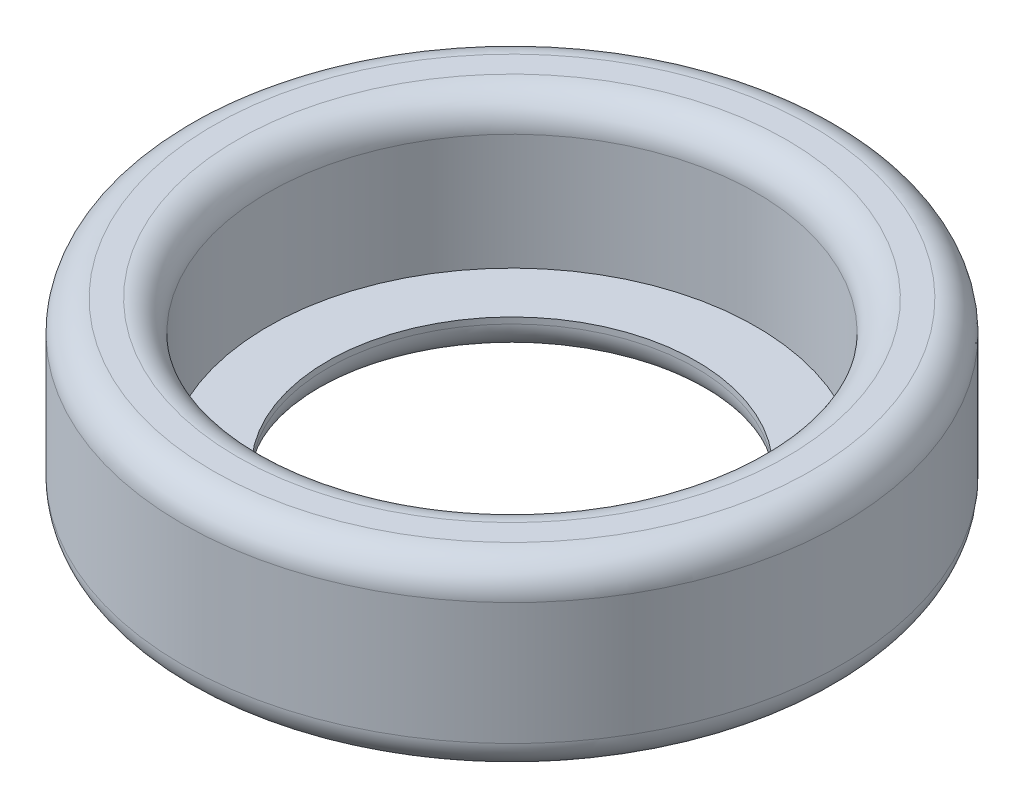
ISO-10303-21;
HEADER;
FILE_DESCRIPTION(('STEP AP214'),'2;1');
FILE_NAME('part.step','',(''),(''),'','','');
FILE_SCHEMA(('AUTOMOTIVE_DESIGN { 1 0 10303 214 1 1 1 1 }'));
ENDSEC;
DATA;
#1=APPLICATION_CONTEXT('core data for automotive mechanical design processes');
#2=APPLICATION_PROTOCOL_DEFINITION('international standard','automotive_design',2000,#1);
#3=PRODUCT_CONTEXT('',#1,'mechanical');
#4=PRODUCT('Part','Part','',(#3));
#5=PRODUCT_RELATED_PRODUCT_CATEGORY('part','',(#4));
#6=PRODUCT_DEFINITION_FORMATION('','',#4);
#7=PRODUCT_DEFINITION_CONTEXT('part definition',#1,'design');
#8=PRODUCT_DEFINITION('design','',#6,#7);
#9=PRODUCT_DEFINITION_SHAPE('','',#8);
#10=(LENGTH_UNIT() NAMED_UNIT(*) SI_UNIT(.MILLI.,.METRE.));
#11=(NAMED_UNIT(*) PLANE_ANGLE_UNIT() SI_UNIT($,.RADIAN.));
#12=(NAMED_UNIT(*) SI_UNIT($,.STERADIAN.) SOLID_ANGLE_UNIT());
#13=UNCERTAINTY_MEASURE_WITH_UNIT(LENGTH_MEASURE(1.E-05),#10,'distance_accuracy_value','');
#14=(GEOMETRIC_REPRESENTATION_CONTEXT(3) GLOBAL_UNCERTAINTY_ASSIGNED_CONTEXT((#13)) GLOBAL_UNIT_ASSIGNED_CONTEXT((#10,
#11,#12)) REPRESENTATION_CONTEXT('',''));
#15=CARTESIAN_POINT('',(0.,0.,0.));
#16=DIRECTION('',(0.,0.,1.));
#17=DIRECTION('',(1.,0.,0.));
#18=AXIS2_PLACEMENT_3D('',#15,#16,#17);
#19=CARTESIAN_POINT('',(0.,15.,0.));
#20=DIRECTION('',(0.,-1.,0.));
#21=DIRECTION('',(0.,0.,-1.));
#22=AXIS2_PLACEMENT_3D('',#19,#20,#21);
#23=CYLINDRICAL_SURFACE('',#22,15.1);
#24=CARTESIAN_POINT('',(0.,2.5,0.));
#25=DIRECTION('',(0.,1.,0.));
#26=DIRECTION('',(0.,0.,1.));
#27=AXIS2_PLACEMENT_3D('',#24,#25,#26);
#28=CIRCLE('',#27,15.1);
#29=CARTESIAN_POINT('',(0.,2.5,15.1));
#30=VERTEX_POINT('',#29);
#31=EDGE_CURVE('E53',#30,#30,#28,.F.);
#32=ORIENTED_EDGE('',*,*,#31,.T.);
#33=EDGE_LOOP('',(#32));
#34=FACE_BOUND('',#33,.T.);
#35=CARTESIAN_POINT('',(0.,3.,0.));
#36=DIRECTION('',(0.,1.,0.));
#37=DIRECTION('',(0.,0.,1.));
#38=AXIS2_PLACEMENT_3D('',#35,#36,#37);
#39=CIRCLE('',#38,15.1);
#40=CARTESIAN_POINT('',(0.,3.,15.1));
#41=VERTEX_POINT('',#40);
#42=EDGE_CURVE('E62',#41,#41,#39,.T.);
#43=ORIENTED_EDGE('',*,*,#42,.T.);
#44=EDGE_LOOP('',(#43));
#45=FACE_BOUND('',#44,.T.);
#46=ADVANCED_FACE('F30',(#34,#45),#23,.F.);
#47=CARTESIAN_POINT('',(0.,15.,0.));
#48=DIRECTION('',(0.,1.,0.));
#49=DIRECTION('',(0.,0.,1.));
#50=AXIS2_PLACEMENT_3D('',#47,#48,#49);
#51=PLANE('',#50);
#52=CARTESIAN_POINT('',(0.,15.,0.));
#53=DIRECTION('',(0.,1.,0.));
#54=DIRECTION('',(0.,0.,1.));
#55=AXIS2_PLACEMENT_3D('',#52,#53,#54);
#56=CIRCLE('',#55,24.5);
#57=CARTESIAN_POINT('',(0.,15.,24.5));
#58=VERTEX_POINT('',#57);
#59=EDGE_CURVE('E37',#58,#58,#56,.T.);
#60=ORIENTED_EDGE('',*,*,#59,.T.);
#61=EDGE_LOOP('',(#60));
#62=FACE_BOUND('',#61,.T.);
#63=CARTESIAN_POINT('',(0.,15.,0.));
#64=DIRECTION('',(0.,1.,0.));
#65=DIRECTION('',(0.,0.,1.));
#66=AXIS2_PLACEMENT_3D('',#63,#64,#65);
#67=CIRCLE('',#66,22.5);
#68=CARTESIAN_POINT('',(0.,15.,22.5));
#69=VERTEX_POINT('',#68);
#70=EDGE_CURVE('E41',#69,#69,#67,.F.);
#71=ORIENTED_EDGE('',*,*,#70,.T.);
#72=EDGE_LOOP('',(#71));
#73=FACE_BOUND('',#72,.T.);
#74=ADVANCED_FACE('F87',(#62,#73),#51,.T.);
#75=CARTESIAN_POINT('',(0.,0.,0.));
#76=DIRECTION('',(0.,1.,0.));
#77=DIRECTION('',(0.,0.,1.));
#78=AXIS2_PLACEMENT_3D('',#75,#76,#77);
#79=PLANE('',#78);
#80=CARTESIAN_POINT('',(0.,0.,0.));
#81=DIRECTION('',(0.,1.,0.));
#82=DIRECTION('',(0.,0.,1.));
#83=AXIS2_PLACEMENT_3D('',#80,#81,#82);
#84=CIRCLE('',#83,17.6);
#85=CARTESIAN_POINT('',(0.,0.,17.6));
#86=VERTEX_POINT('',#85);
#87=EDGE_CURVE('E56',#86,#86,#84,.T.);
#88=ORIENTED_EDGE('',*,*,#87,.T.);
#89=EDGE_LOOP('',(#88));
#90=FACE_BOUND('',#89,.T.);
#91=CARTESIAN_POINT('',(0.,0.,0.));
#92=DIRECTION('',(0.,1.,0.));
#93=DIRECTION('',(0.,0.,1.));
#94=AXIS2_PLACEMENT_3D('',#91,#92,#93);
#95=CIRCLE('',#94,24.5);
#96=CARTESIAN_POINT('',(0.,0.,24.5));
#97=VERTEX_POINT('',#96);
#98=EDGE_CURVE('E59',#97,#97,#95,.F.);
#99=ORIENTED_EDGE('',*,*,#98,.T.);
#100=EDGE_LOOP('',(#99));
#101=FACE_BOUND('',#100,.T.);
#102=ADVANCED_FACE('F82',(#90,#101),#79,.F.);
#103=CARTESIAN_POINT('',(0.,15.,0.));
#104=DIRECTION('',(0.,-1.,0.));
#105=DIRECTION('',(0.,0.,-1.));
#106=AXIS2_PLACEMENT_3D('',#103,#104,#105);
#107=CYLINDRICAL_SURFACE('',#106,27.);
#108=CARTESIAN_POINT('',(0.,2.5,0.));
#109=DIRECTION('',(0.,1.,0.));
#110=DIRECTION('',(0.,0.,1.));
#111=AXIS2_PLACEMENT_3D('',#108,#109,#110);
#112=CIRCLE('',#111,27.);
#113=CARTESIAN_POINT('',(0.,2.5,27.));
#114=VERTEX_POINT('',#113);
#115=EDGE_CURVE('E45',#114,#114,#112,.T.);
#116=ORIENTED_EDGE('',*,*,#115,.T.);
#117=EDGE_LOOP('',(#116));
#118=FACE_BOUND('',#117,.T.);
#119=CARTESIAN_POINT('',(0.,12.5,0.));
#120=DIRECTION('',(0.,1.,0.));
#121=DIRECTION('',(0.,0.,1.));
#122=AXIS2_PLACEMENT_3D('',#119,#120,#121);
#123=CIRCLE('',#122,27.);
#124=CARTESIAN_POINT('',(0.,12.5,27.));
#125=VERTEX_POINT('',#124);
#126=EDGE_CURVE('E50',#125,#125,#123,.F.);
#127=ORIENTED_EDGE('',*,*,#126,.T.);
#128=EDGE_LOOP('',(#127));
#129=FACE_BOUND('',#128,.T.);
#130=ADVANCED_FACE('F73',(#118,#129),#107,.T.);
#131=CARTESIAN_POINT('',(0.,3.,0.));
#132=DIRECTION('',(0.,1.,0.));
#133=DIRECTION('',(0.,0.,1.));
#134=AXIS2_PLACEMENT_3D('',#131,#132,#133);
#135=CYLINDRICAL_SURFACE('',#134,20.);
#136=CARTESIAN_POINT('',(0.,12.5,0.));
#137=DIRECTION('',(0.,1.,0.));
#138=DIRECTION('',(0.,0.,1.));
#139=AXIS2_PLACEMENT_3D('',#136,#137,#138);
#140=CIRCLE('',#139,20.);
#141=CARTESIAN_POINT('',(0.,12.5,20.));
#142=VERTEX_POINT('',#141);
#143=EDGE_CURVE('E10',#142,#142,#140,.T.);
#144=ORIENTED_EDGE('',*,*,#143,.T.);
#145=EDGE_LOOP('',(#144));
#146=FACE_BOUND('',#145,.T.);
#147=CARTESIAN_POINT('',(0.,3.,0.));
#148=DIRECTION('',(0.,1.,0.));
#149=DIRECTION('',(0.,0.,1.));
#150=AXIS2_PLACEMENT_3D('',#147,#148,#149);
#151=CIRCLE('',#150,20.);
#152=CARTESIAN_POINT('',(0.,3.,20.));
#153=VERTEX_POINT('',#152);
#154=EDGE_CURVE('E65',#153,#153,#151,.T.);
#155=ORIENTED_EDGE('',*,*,#154,.F.);
#156=EDGE_LOOP('',(#155));
#157=FACE_BOUND('',#156,.T.);
#158=ADVANCED_FACE('F71',(#146,#157),#135,.F.);
#159=CARTESIAN_POINT('',(0.,3.,0.));
#160=DIRECTION('',(0.,1.,0.));
#161=DIRECTION('',(0.,0.,1.));
#162=AXIS2_PLACEMENT_3D('',#159,#160,#161);
#163=PLANE('',#162);
#164=ORIENTED_EDGE('',*,*,#42,.F.);
#165=EDGE_LOOP('',(#164));
#166=FACE_BOUND('',#165,.T.);
#167=ORIENTED_EDGE('',*,*,#154,.T.);
#168=EDGE_LOOP('',(#167));
#169=FACE_BOUND('',#168,.T.);
#170=ADVANCED_FACE('F69',(#166,#169),#163,.T.);
#171=CARTESIAN_POINT('',(0.,2.5,0.));
#172=DIRECTION('',(0.,1.,0.));
#173=DIRECTION('',(0.,0.,1.));
#174=AXIS2_PLACEMENT_3D('',#171,#172,#173);
#175=TOROIDAL_SURFACE('',#174,17.6,2.5);
#176=ORIENTED_EDGE('',*,*,#31,.F.);
#177=EDGE_LOOP('',(#176));
#178=FACE_BOUND('',#177,.T.);
#179=ORIENTED_EDGE('',*,*,#87,.F.);
#180=EDGE_LOOP('',(#179));
#181=FACE_BOUND('',#180,.T.);
#182=ADVANCED_FACE('F79',(#178,#181),#175,.T.);
#183=CARTESIAN_POINT('',(0.,2.5,0.));
#184=DIRECTION('',(0.,1.,0.));
#185=DIRECTION('',(0.,0.,1.));
#186=AXIS2_PLACEMENT_3D('',#183,#184,#185);
#187=TOROIDAL_SURFACE('',#186,24.5,2.5);
#188=ORIENTED_EDGE('',*,*,#98,.F.);
#189=EDGE_LOOP('',(#188));
#190=FACE_BOUND('',#189,.T.);
#191=ORIENTED_EDGE('',*,*,#115,.F.);
#192=EDGE_LOOP('',(#191));
#193=FACE_BOUND('',#192,.T.);
#194=ADVANCED_FACE('F100',(#190,#193),#187,.T.);
#195=CARTESIAN_POINT('',(0.,12.5,0.));
#196=DIRECTION('',(0.,1.,0.));
#197=DIRECTION('',(0.,0.,1.));
#198=AXIS2_PLACEMENT_3D('',#195,#196,#197);
#199=TOROIDAL_SURFACE('',#198,24.5,2.5);
#200=ORIENTED_EDGE('',*,*,#126,.F.);
#201=EDGE_LOOP('',(#200));
#202=FACE_BOUND('',#201,.T.);
#203=ORIENTED_EDGE('',*,*,#59,.F.);
#204=EDGE_LOOP('',(#203));
#205=FACE_BOUND('',#204,.T.);
#206=ADVANCED_FACE('F103',(#202,#205),#199,.T.);
#207=CARTESIAN_POINT('',(0.,12.5,0.));
#208=DIRECTION('',(0.,1.,0.));
#209=DIRECTION('',(0.,0.,1.));
#210=AXIS2_PLACEMENT_3D('',#207,#208,#209);
#211=TOROIDAL_SURFACE('',#210,22.5,2.5);
#212=ORIENTED_EDGE('',*,*,#70,.F.);
#213=EDGE_LOOP('',(#212));
#214=FACE_BOUND('',#213,.T.);
#215=ORIENTED_EDGE('',*,*,#143,.F.);
#216=EDGE_LOOP('',(#215));
#217=FACE_BOUND('',#216,.T.);
#218=ADVANCED_FACE('F32',(#214,#217),#211,.T.);
#219=CLOSED_SHELL('',(#46,#74,#102,#130,#158,#170,#182,#194,#206,#218));
#220=MANIFOLD_SOLID_BREP('B2',#219);
#221=ADVANCED_BREP_SHAPE_REPRESENTATION('',(#18,#220),#14);
#222=SHAPE_DEFINITION_REPRESENTATION(#9,#221);
ENDSEC;
END-ISO-10303-21;
